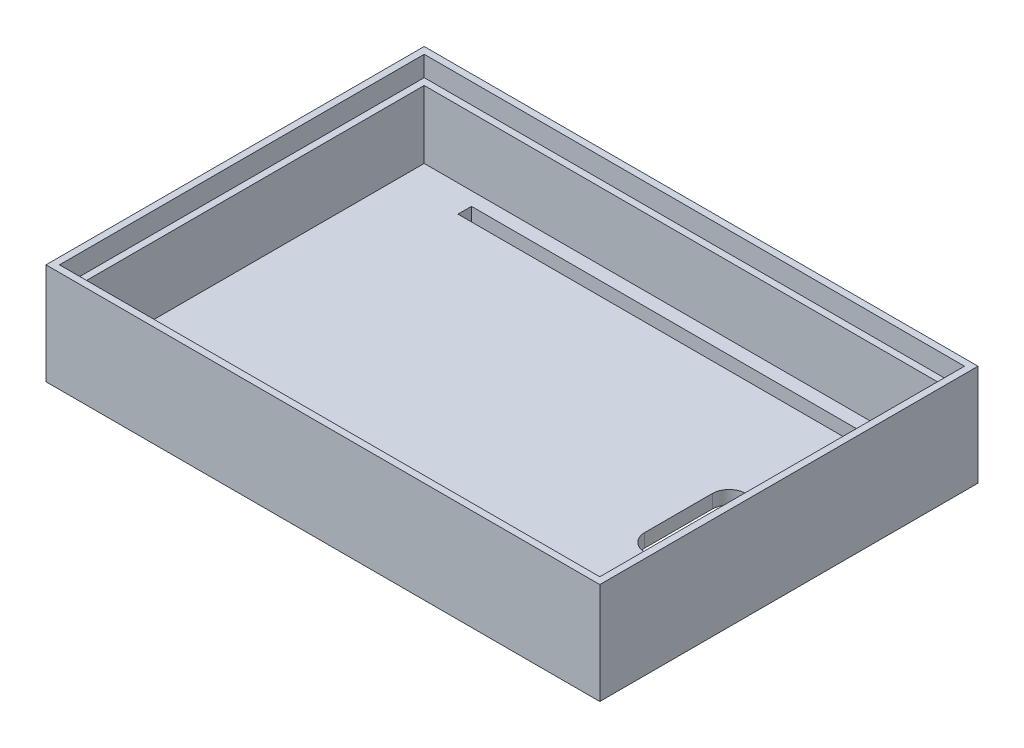
ISO-10303-21;
HEADER;
FILE_DESCRIPTION(('STEP AP214'),'2;1');
FILE_NAME('part.step','',(''),(''),'','','');
FILE_SCHEMA(('AUTOMOTIVE_DESIGN { 1 0 10303 214 1 1 1 1 }'));
ENDSEC;
DATA;
#1=APPLICATION_CONTEXT('core data for automotive mechanical design processes');
#2=APPLICATION_PROTOCOL_DEFINITION('international standard','automotive_design',2000,#1);
#3=PRODUCT_CONTEXT('',#1,'mechanical');
#4=PRODUCT('Part','Part','',(#3));
#5=PRODUCT_RELATED_PRODUCT_CATEGORY('part','',(#4));
#6=PRODUCT_DEFINITION_FORMATION('','',#4);
#7=PRODUCT_DEFINITION_CONTEXT('part definition',#1,'design');
#8=PRODUCT_DEFINITION('design','',#6,#7);
#9=PRODUCT_DEFINITION_SHAPE('','',#8);
#10=(LENGTH_UNIT() NAMED_UNIT(*) SI_UNIT(.MILLI.,.METRE.));
#11=(NAMED_UNIT(*) PLANE_ANGLE_UNIT() SI_UNIT($,.RADIAN.));
#12=(NAMED_UNIT(*) SI_UNIT($,.STERADIAN.) SOLID_ANGLE_UNIT());
#13=UNCERTAINTY_MEASURE_WITH_UNIT(LENGTH_MEASURE(1.E-05),#10,'distance_accuracy_value','');
#14=(GEOMETRIC_REPRESENTATION_CONTEXT(3) GLOBAL_UNCERTAINTY_ASSIGNED_CONTEXT((#13)) GLOBAL_UNIT_ASSIGNED_CONTEXT((#10,
#11,#12)) REPRESENTATION_CONTEXT('',''));
#15=CARTESIAN_POINT('',(0.,0.,0.));
#16=DIRECTION('',(0.,0.,1.));
#17=DIRECTION('',(1.,0.,0.));
#18=AXIS2_PLACEMENT_3D('',#15,#16,#17);
#19=CARTESIAN_POINT('',(0.,15.,0.));
#20=DIRECTION('',(1.,0.,0.));
#21=DIRECTION('',(0.,0.,-1.));
#22=AXIS2_PLACEMENT_3D('',#19,#20,#21);
#23=PLANE('',#22);
#24=DIRECTION('',(0.,0.,1.));
#25=VECTOR('',#24,1.);
#26=CARTESIAN_POINT('',(0.,0.,0.));
#27=LINE('',#26,#25);
#28=CARTESIAN_POINT('',(0.,0.,-56.));
#29=VERTEX_POINT('',#28);
#30=CARTESIAN_POINT('',(0.,0.,0.));
#31=VERTEX_POINT('',#30);
#32=EDGE_CURVE('E543',#29,#31,#27,.T.);
#33=ORIENTED_EDGE('',*,*,#32,.T.);
#34=DIRECTION('',(0.,-1.,0.));
#35=VECTOR('',#34,1.);
#36=CARTESIAN_POINT('',(0.,15.,0.));
#37=LINE('',#36,#35);
#38=CARTESIAN_POINT('',(0.,15.,0.));
#39=VERTEX_POINT('',#38);
#40=EDGE_CURVE('E590',#39,#31,#37,.T.);
#41=ORIENTED_EDGE('',*,*,#40,.F.);
#42=DIRECTION('',(0.,0.,1.));
#43=VECTOR('',#42,1.);
#44=CARTESIAN_POINT('',(0.,15.,0.));
#45=LINE('',#44,#43);
#46=CARTESIAN_POINT('',(0.,15.,-56.));
#47=VERTEX_POINT('',#46);
#48=EDGE_CURVE('E553',#47,#39,#45,.T.);
#49=ORIENTED_EDGE('',*,*,#48,.F.);
#50=DIRECTION('',(0.,-1.,0.));
#51=VECTOR('',#50,1.);
#52=CARTESIAN_POINT('',(0.,15.,-56.));
#53=LINE('',#52,#51);
#54=EDGE_CURVE('E567',#47,#29,#53,.T.);
#55=ORIENTED_EDGE('',*,*,#54,.T.);
#56=EDGE_LOOP('',(#33,#41,#49,#55));
#57=FACE_BOUND('',#56,.T.);
#58=ADVANCED_FACE('F160',(#57),#23,.F.);
#59=CARTESIAN_POINT('',(0.,15.,0.));
#60=DIRECTION('',(0.,0.,-1.));
#61=DIRECTION('',(-1.,0.,0.));
#62=AXIS2_PLACEMENT_3D('',#59,#60,#61);
#63=PLANE('',#62);
#64=DIRECTION('',(1.,0.,0.));
#65=VECTOR('',#64,1.);
#66=CARTESIAN_POINT('',(0.,0.,0.));
#67=LINE('',#66,#65);
#68=CARTESIAN_POINT('',(82.,0.,0.));
#69=VERTEX_POINT('',#68);
#70=EDGE_CURVE('E571',#31,#69,#67,.T.);
#71=ORIENTED_EDGE('',*,*,#70,.T.);
#72=DIRECTION('',(0.,-1.,0.));
#73=VECTOR('',#72,1.);
#74=CARTESIAN_POINT('',(82.,15.,0.));
#75=LINE('',#74,#73);
#76=CARTESIAN_POINT('',(82.,15.,0.));
#77=VERTEX_POINT('',#76);
#78=EDGE_CURVE('E586',#77,#69,#75,.T.);
#79=ORIENTED_EDGE('',*,*,#78,.F.);
#80=DIRECTION('',(1.,0.,0.));
#81=VECTOR('',#80,1.);
#82=CARTESIAN_POINT('',(0.,15.,0.));
#83=LINE('',#82,#81);
#84=EDGE_CURVE('E557',#39,#77,#83,.T.);
#85=ORIENTED_EDGE('',*,*,#84,.F.);
#86=ORIENTED_EDGE('',*,*,#40,.T.);
#87=EDGE_LOOP('',(#71,#79,#85,#86));
#88=FACE_BOUND('',#87,.T.);
#89=ADVANCED_FACE('F661',(#88),#63,.F.);
#90=CARTESIAN_POINT('',(82.,15.,0.));
#91=DIRECTION('',(-1.,0.,0.));
#92=DIRECTION('',(0.,0.,1.));
#93=AXIS2_PLACEMENT_3D('',#90,#91,#92);
#94=PLANE('',#93);
#95=DIRECTION('',(0.,0.,-1.));
#96=VECTOR('',#95,1.);
#97=CARTESIAN_POINT('',(82.,0.,0.));
#98=LINE('',#97,#96);
#99=CARTESIAN_POINT('',(82.,0.,-56.));
#100=VERTEX_POINT('',#99);
#101=EDGE_CURVE('E574',#69,#100,#98,.T.);
#102=ORIENTED_EDGE('',*,*,#101,.T.);
#103=DIRECTION('',(0.,-1.,0.));
#104=VECTOR('',#103,1.);
#105=CARTESIAN_POINT('',(82.,15.,-56.));
#106=LINE('',#105,#104);
#107=CARTESIAN_POINT('',(82.,15.,-56.));
#108=VERTEX_POINT('',#107);
#109=EDGE_CURVE('E582',#108,#100,#106,.T.);
#110=ORIENTED_EDGE('',*,*,#109,.F.);
#111=DIRECTION('',(0.,0.,-1.));
#112=VECTOR('',#111,1.);
#113=CARTESIAN_POINT('',(82.,15.,0.));
#114=LINE('',#113,#112);
#115=EDGE_CURVE('E561',#77,#108,#114,.T.);
#116=ORIENTED_EDGE('',*,*,#115,.F.);
#117=ORIENTED_EDGE('',*,*,#78,.T.);
#118=EDGE_LOOP('',(#102,#110,#116,#117));
#119=FACE_BOUND('',#118,.T.);
#120=ADVANCED_FACE('F666',(#119),#94,.F.);
#121=CARTESIAN_POINT('',(0.,15.,-56.));
#122=DIRECTION('',(0.,0.,1.));
#123=DIRECTION('',(1.,0.,0.));
#124=AXIS2_PLACEMENT_3D('',#121,#122,#123);
#125=PLANE('',#124);
#126=DIRECTION('',(-1.,0.,0.));
#127=VECTOR('',#126,1.);
#128=CARTESIAN_POINT('',(0.,0.,-56.));
#129=LINE('',#128,#127);
#130=EDGE_CURVE('E558',#100,#29,#129,.T.);
#131=ORIENTED_EDGE('',*,*,#130,.T.);
#132=ORIENTED_EDGE('',*,*,#54,.F.);
#133=DIRECTION('',(-1.,0.,0.));
#134=VECTOR('',#133,1.);
#135=CARTESIAN_POINT('',(0.,15.,-56.));
#136=LINE('',#135,#134);
#137=EDGE_CURVE('E564',#108,#47,#136,.T.);
#138=ORIENTED_EDGE('',*,*,#137,.F.);
#139=ORIENTED_EDGE('',*,*,#109,.T.);
#140=EDGE_LOOP('',(#131,#132,#138,#139));
#141=FACE_BOUND('',#140,.T.);
#142=ADVANCED_FACE('F682',(#141),#125,.F.);
#143=CARTESIAN_POINT('',(0.,15.,0.));
#144=DIRECTION('',(0.,-1.,0.));
#145=DIRECTION('',(0.,0.,-1.));
#146=AXIS2_PLACEMENT_3D('',#143,#144,#145);
#147=PLANE('',#146);
#148=DIRECTION('',(1.,0.,0.));
#149=VECTOR('',#148,1.);
#150=CARTESIAN_POINT('',(1.00000000000001,15.,-1.));
#151=LINE('',#150,#149);
#152=CARTESIAN_POINT('',(1.00000000000001,15.,-1.));
#153=VERTEX_POINT('',#152);
#154=CARTESIAN_POINT('',(81.,15.,-1.));
#155=VERTEX_POINT('',#154);
#156=EDGE_CURVE('E529',#153,#155,#151,.T.);
#157=ORIENTED_EDGE('',*,*,#156,.F.);
#158=DIRECTION('',(0.,0.,1.));
#159=VECTOR('',#158,1.);
#160=CARTESIAN_POINT('',(1.,15.,-55.));
#161=LINE('',#160,#159);
#162=CARTESIAN_POINT('',(1.,15.,-55.));
#163=VERTEX_POINT('',#162);
#164=EDGE_CURVE('E460',#163,#153,#161,.T.);
#165=ORIENTED_EDGE('',*,*,#164,.F.);
#166=DIRECTION('',(-1.,0.,0.));
#167=VECTOR('',#166,1.);
#168=CARTESIAN_POINT('',(1.,15.,-55.));
#169=LINE('',#168,#167);
#170=CARTESIAN_POINT('',(81.,15.,-55.));
#171=VERTEX_POINT('',#170);
#172=EDGE_CURVE('E514',#171,#163,#169,.T.);
#173=ORIENTED_EDGE('',*,*,#172,.F.);
#174=DIRECTION('',(0.,0.,-1.));
#175=VECTOR('',#174,1.);
#176=CARTESIAN_POINT('',(81.,15.,-55.));
#177=LINE('',#176,#175);
#178=EDGE_CURVE('E533',#155,#171,#177,.T.);
#179=ORIENTED_EDGE('',*,*,#178,.F.);
#180=EDGE_LOOP('',(#157,#165,#173,#179));
#181=FACE_BOUND('',#180,.T.);
#182=ORIENTED_EDGE('',*,*,#48,.T.);
#183=ORIENTED_EDGE('',*,*,#84,.T.);
#184=ORIENTED_EDGE('',*,*,#115,.T.);
#185=ORIENTED_EDGE('',*,*,#137,.T.);
#186=EDGE_LOOP('',(#182,#183,#184,#185));
#187=FACE_BOUND('',#186,.T.);
#188=ADVANCED_FACE('F678',(#181,#187),#147,.F.);
#189=CARTESIAN_POINT('',(0.,0.,0.));
#190=DIRECTION('',(0.,-1.,0.));
#191=DIRECTION('',(0.,0.,-1.));
#192=AXIS2_PLACEMENT_3D('',#189,#190,#191);
#193=PLANE('',#192);
#194=DIRECTION('',(0.,0.,-1.));
#195=VECTOR('',#194,1.);
#196=CARTESIAN_POINT('',(11.,0.,-4.));
#197=LINE('',#196,#195);
#198=CARTESIAN_POINT('',(11.,0.,-4.));
#199=VERTEX_POINT('',#198);
#200=CARTESIAN_POINT('',(11.,0.,-5.99999999999999));
#201=VERTEX_POINT('',#200);
#202=EDGE_CURVE('E175',#199,#201,#197,.T.);
#203=ORIENTED_EDGE('',*,*,#202,.F.);
#204=DIRECTION('',(-1.,0.,0.));
#205=VECTOR('',#204,1.);
#206=CARTESIAN_POINT('',(11.,0.,-4.));
#207=LINE('',#206,#205);
#208=CARTESIAN_POINT('',(71.,0.,-3.99999999999999));
#209=VERTEX_POINT('',#208);
#210=EDGE_CURVE('E359',#209,#199,#207,.T.);
#211=ORIENTED_EDGE('',*,*,#210,.F.);
#212=DIRECTION('',(0.,0.,1.));
#213=VECTOR('',#212,1.);
#214=CARTESIAN_POINT('',(71.,0.,-3.99999999999999));
#215=LINE('',#214,#213);
#216=CARTESIAN_POINT('',(71.,0.,-5.99999999999999));
#217=VERTEX_POINT('',#216);
#218=EDGE_CURVE('E340',#217,#209,#215,.T.);
#219=ORIENTED_EDGE('',*,*,#218,.F.);
#220=DIRECTION('',(1.,0.,0.));
#221=VECTOR('',#220,1.);
#222=CARTESIAN_POINT('',(11.,0.,-5.99999999999999));
#223=LINE('',#222,#221);
#224=EDGE_CURVE('E351',#201,#217,#223,.T.);
#225=ORIENTED_EDGE('',*,*,#224,.F.);
#226=EDGE_LOOP('',(#203,#211,#219,#225));
#227=FACE_BOUND('',#226,.T.);
#228=DIRECTION('',(0.,0.,-1.));
#229=VECTOR('',#228,1.);
#230=CARTESIAN_POINT('',(11.,0.,-52.));
#231=LINE('',#230,#229);
#232=CARTESIAN_POINT('',(11.,0.,-50.));
#233=VERTEX_POINT('',#232);
#234=CARTESIAN_POINT('',(11.,0.,-52.));
#235=VERTEX_POINT('',#234);
#236=EDGE_CURVE('E183',#233,#235,#231,.T.);
#237=ORIENTED_EDGE('',*,*,#236,.F.);
#238=DIRECTION('',(-1.,0.,0.));
#239=VECTOR('',#238,1.);
#240=CARTESIAN_POINT('',(11.,0.,-50.));
#241=LINE('',#240,#239);
#242=CARTESIAN_POINT('',(71.,0.,-50.));
#243=VERTEX_POINT('',#242);
#244=EDGE_CURVE('E377',#243,#233,#241,.T.);
#245=ORIENTED_EDGE('',*,*,#244,.F.);
#246=DIRECTION('',(0.,0.,1.));
#247=VECTOR('',#246,1.);
#248=CARTESIAN_POINT('',(71.,0.,-52.));
#249=LINE('',#248,#247);
#250=CARTESIAN_POINT('',(71.,0.,-52.));
#251=VERTEX_POINT('',#250);
#252=EDGE_CURVE('E391',#251,#243,#249,.T.);
#253=ORIENTED_EDGE('',*,*,#252,.F.);
#254=DIRECTION('',(1.,0.,0.));
#255=VECTOR('',#254,1.);
#256=CARTESIAN_POINT('',(11.,0.,-52.));
#257=LINE('',#256,#255);
#258=EDGE_CURVE('E395',#235,#251,#257,.T.);
#259=ORIENTED_EDGE('',*,*,#258,.F.);
#260=EDGE_LOOP('',(#237,#245,#253,#259));
#261=FACE_BOUND('',#260,.T.);
#262=CARTESIAN_POINT('',(68.1538059373532,0.,-23.));
#263=DIRECTION('',(0.,-1.,0.));
#264=DIRECTION('',(0.,0.,-1.));
#265=AXIS2_PLACEMENT_3D('',#262,#263,#264);
#266=CIRCLE('',#265,2.5);
#267=CARTESIAN_POINT('',(70.6538059373532,0.,-23.));
#268=VERTEX_POINT('',#267);
#269=CARTESIAN_POINT('',(65.6538059373532,0.,-23.));
#270=VERTEX_POINT('',#269);
#271=EDGE_CURVE('E387',#268,#270,#266,.T.);
#272=ORIENTED_EDGE('',*,*,#271,.F.);
#273=DIRECTION('',(0.,0.,1.));
#274=VECTOR('',#273,1.);
#275=CARTESIAN_POINT('',(70.6538059373532,0.,-23.));
#276=LINE('',#275,#274);
#277=CARTESIAN_POINT('',(70.6538059373532,0.,-25.5));
#278=VERTEX_POINT('',#277);
#279=EDGE_CURVE('E405',#278,#268,#276,.T.);
#280=ORIENTED_EDGE('',*,*,#279,.F.);
#281=CARTESIAN_POINT('',(70.6538059373532,0.,-28.));
#282=DIRECTION('',(0.,-1.,0.));
#283=DIRECTION('',(0.,0.,1.));
#284=AXIS2_PLACEMENT_3D('',#281,#282,#283);
#285=CIRCLE('',#284,2.5);
#286=CARTESIAN_POINT('',(70.6538059373532,0.,-30.5));
#287=VERTEX_POINT('',#286);
#288=EDGE_CURVE('E424',#287,#278,#285,.T.);
#289=ORIENTED_EDGE('',*,*,#288,.F.);
#290=DIRECTION('',(0.,0.,1.));
#291=VECTOR('',#290,1.);
#292=CARTESIAN_POINT('',(70.6538059373532,0.,-30.5));
#293=LINE('',#292,#291);
#294=CARTESIAN_POINT('',(70.6538059373532,0.,-33.));
#295=VERTEX_POINT('',#294);
#296=EDGE_CURVE('E428',#295,#287,#293,.T.);
#297=ORIENTED_EDGE('',*,*,#296,.F.);
#298=CARTESIAN_POINT('',(68.1538059373532,0.,-33.));
#299=DIRECTION('',(0.,-1.,0.));
#300=DIRECTION('',(0.,0.,-1.));
#301=AXIS2_PLACEMENT_3D('',#298,#299,#300);
#302=CIRCLE('',#301,2.5);
#303=CARTESIAN_POINT('',(65.6538059373532,0.,-33.));
#304=VERTEX_POINT('',#303);
#305=EDGE_CURVE('E432',#304,#295,#302,.T.);
#306=ORIENTED_EDGE('',*,*,#305,.F.);
#307=DIRECTION('',(0.,0.,-1.));
#308=VECTOR('',#307,1.);
#309=CARTESIAN_POINT('',(65.6538059373532,0.,-23.));
#310=LINE('',#309,#308);
#311=EDGE_CURVE('E436',#270,#304,#310,.T.);
#312=ORIENTED_EDGE('',*,*,#311,.F.);
#313=EDGE_LOOP('',(#272,#280,#289,#297,#306,#312));
#314=FACE_BOUND('',#313,.T.);
#315=ORIENTED_EDGE('',*,*,#32,.F.);
#316=ORIENTED_EDGE('',*,*,#130,.F.);
#317=ORIENTED_EDGE('',*,*,#101,.F.);
#318=ORIENTED_EDGE('',*,*,#70,.F.);
#319=EDGE_LOOP('',(#315,#316,#317,#318));
#320=FACE_BOUND('',#319,.T.);
#321=ADVANCED_FACE('F356',(#227,#261,#314,#320),#193,.T.);
#322=CARTESIAN_POINT('',(1.,12.,-55.));
#323=DIRECTION('',(-1.,0.,0.));
#324=DIRECTION('',(0.,0.,1.));
#325=AXIS2_PLACEMENT_3D('',#322,#323,#324);
#326=PLANE('',#325);
#327=ORIENTED_EDGE('',*,*,#164,.T.);
#328=DIRECTION('',(0.,1.,0.));
#329=VECTOR('',#328,1.);
#330=CARTESIAN_POINT('',(1.00000000000001,12.,-1.));
#331=LINE('',#330,#329);
#332=CARTESIAN_POINT('',(1.00000000000001,12.,-1.));
#333=VERTEX_POINT('',#332);
#334=EDGE_CURVE('E526',#333,#153,#331,.T.);
#335=ORIENTED_EDGE('',*,*,#334,.F.);
#336=DIRECTION('',(0.,0.,1.));
#337=VECTOR('',#336,1.);
#338=CARTESIAN_POINT('',(1.,12.,-55.));
#339=LINE('',#338,#337);
#340=CARTESIAN_POINT('',(1.,12.,-55.));
#341=VERTEX_POINT('',#340);
#342=EDGE_CURVE('E509',#341,#333,#339,.T.);
#343=ORIENTED_EDGE('',*,*,#342,.F.);
#344=DIRECTION('',(0.,1.,0.));
#345=VECTOR('',#344,1.);
#346=CARTESIAN_POINT('',(1.,12.,-55.));
#347=LINE('',#346,#345);
#348=EDGE_CURVE('E540',#341,#163,#347,.T.);
#349=ORIENTED_EDGE('',*,*,#348,.T.);
#350=EDGE_LOOP('',(#327,#335,#343,#349));
#351=FACE_BOUND('',#350,.T.);
#352=ADVANCED_FACE('F693',(#351),#326,.F.);
#353=CARTESIAN_POINT('',(1.,12.,-55.));
#354=DIRECTION('',(0.,0.,-1.));
#355=DIRECTION('',(-1.,0.,0.));
#356=AXIS2_PLACEMENT_3D('',#353,#354,#355);
#357=PLANE('',#356);
#358=ORIENTED_EDGE('',*,*,#172,.T.);
#359=ORIENTED_EDGE('',*,*,#348,.F.);
#360=DIRECTION('',(-1.,0.,0.));
#361=VECTOR('',#360,1.);
#362=CARTESIAN_POINT('',(1.,12.,-55.));
#363=LINE('',#362,#361);
#364=CARTESIAN_POINT('',(81.,12.,-55.));
#365=VERTEX_POINT('',#364);
#366=EDGE_CURVE('E522',#365,#341,#363,.T.);
#367=ORIENTED_EDGE('',*,*,#366,.F.);
#368=DIRECTION('',(0.,1.,0.));
#369=VECTOR('',#368,1.);
#370=CARTESIAN_POINT('',(81.,12.,-55.));
#371=LINE('',#370,#369);
#372=EDGE_CURVE('E544',#365,#171,#371,.T.);
#373=ORIENTED_EDGE('',*,*,#372,.T.);
#374=EDGE_LOOP('',(#358,#359,#367,#373));
#375=FACE_BOUND('',#374,.T.);
#376=ADVANCED_FACE('F699',(#375),#357,.F.);
#377=CARTESIAN_POINT('',(81.,12.,-55.));
#378=DIRECTION('',(1.,0.,0.));
#379=DIRECTION('',(0.,0.,-1.));
#380=AXIS2_PLACEMENT_3D('',#377,#378,#379);
#381=PLANE('',#380);
#382=ORIENTED_EDGE('',*,*,#178,.T.);
#383=ORIENTED_EDGE('',*,*,#372,.F.);
#384=DIRECTION('',(0.,0.,-1.));
#385=VECTOR('',#384,1.);
#386=CARTESIAN_POINT('',(81.,12.,-55.));
#387=LINE('',#386,#385);
#388=CARTESIAN_POINT('',(81.,12.,-1.));
#389=VERTEX_POINT('',#388);
#390=EDGE_CURVE('E518',#389,#365,#387,.T.);
#391=ORIENTED_EDGE('',*,*,#390,.F.);
#392=DIRECTION('',(0.,1.,0.));
#393=VECTOR('',#392,1.);
#394=CARTESIAN_POINT('',(81.,12.,-1.));
#395=LINE('',#394,#393);
#396=EDGE_CURVE('E547',#389,#155,#395,.T.);
#397=ORIENTED_EDGE('',*,*,#396,.T.);
#398=EDGE_LOOP('',(#382,#383,#391,#397));
#399=FACE_BOUND('',#398,.T.);
#400=ADVANCED_FACE('F705',(#399),#381,.F.);
#401=CARTESIAN_POINT('',(1.00000000000001,12.,-1.));
#402=DIRECTION('',(0.,0.,1.));
#403=DIRECTION('',(1.,0.,0.));
#404=AXIS2_PLACEMENT_3D('',#401,#402,#403);
#405=PLANE('',#404);
#406=ORIENTED_EDGE('',*,*,#156,.T.);
#407=ORIENTED_EDGE('',*,*,#396,.F.);
#408=DIRECTION('',(1.,0.,0.));
#409=VECTOR('',#408,1.);
#410=CARTESIAN_POINT('',(1.00000000000001,12.,-1.));
#411=LINE('',#410,#409);
#412=EDGE_CURVE('E513',#333,#389,#411,.T.);
#413=ORIENTED_EDGE('',*,*,#412,.F.);
#414=ORIENTED_EDGE('',*,*,#334,.T.);
#415=EDGE_LOOP('',(#406,#407,#413,#414));
#416=FACE_BOUND('',#415,.T.);
#417=ADVANCED_FACE('F701',(#416),#405,.F.);
#418=CARTESIAN_POINT('',(0.,12.,0.));
#419=DIRECTION('',(0.,1.,0.));
#420=DIRECTION('',(0.,0.,1.));
#421=AXIS2_PLACEMENT_3D('',#418,#419,#420);
#422=PLANE('',#421);
#423=DIRECTION('',(1.,0.,0.));
#424=VECTOR('',#423,1.);
#425=CARTESIAN_POINT('',(2.,12.,-2.00000000000001));
#426=LINE('',#425,#424);
#427=CARTESIAN_POINT('',(2.,12.,-2.00000000000001));
#428=VERTEX_POINT('',#427);
#429=CARTESIAN_POINT('',(80.,12.,-2.));
#430=VERTEX_POINT('',#429);
#431=EDGE_CURVE('E456',#428,#430,#426,.T.);
#432=ORIENTED_EDGE('',*,*,#431,.F.);
#433=DIRECTION('',(0.,0.,1.));
#434=VECTOR('',#433,1.);
#435=CARTESIAN_POINT('',(2.,12.,-54.));
#436=LINE('',#435,#434);
#437=CARTESIAN_POINT('',(2.,12.,-54.));
#438=VERTEX_POINT('',#437);
#439=EDGE_CURVE('E447',#438,#428,#436,.T.);
#440=ORIENTED_EDGE('',*,*,#439,.F.);
#441=DIRECTION('',(-1.,0.,0.));
#442=VECTOR('',#441,1.);
#443=CARTESIAN_POINT('',(80.,12.,-54.));
#444=LINE('',#443,#442);
#445=CARTESIAN_POINT('',(80.,12.,-54.));
#446=VERTEX_POINT('',#445);
#447=EDGE_CURVE('E487',#446,#438,#444,.T.);
#448=ORIENTED_EDGE('',*,*,#447,.F.);
#449=DIRECTION('',(0.,0.,-1.));
#450=VECTOR('',#449,1.);
#451=CARTESIAN_POINT('',(80.,12.,-2.));
#452=LINE('',#451,#450);
#453=EDGE_CURVE('E468',#430,#446,#452,.T.);
#454=ORIENTED_EDGE('',*,*,#453,.F.);
#455=EDGE_LOOP('',(#432,#440,#448,#454));
#456=FACE_BOUND('',#455,.T.);
#457=ORIENTED_EDGE('',*,*,#342,.T.);
#458=ORIENTED_EDGE('',*,*,#412,.T.);
#459=ORIENTED_EDGE('',*,*,#390,.T.);
#460=ORIENTED_EDGE('',*,*,#366,.T.);
#461=EDGE_LOOP('',(#457,#458,#459,#460));
#462=FACE_BOUND('',#461,.T.);
#463=ADVANCED_FACE('F704',(#456,#462),#422,.T.);
#464=CARTESIAN_POINT('',(0.,2.,0.));
#465=DIRECTION('',(0.,-1.,0.));
#466=DIRECTION('',(0.,0.,-1.));
#467=AXIS2_PLACEMENT_3D('',#464,#465,#466);
#468=PLANE('',#467);
#469=DIRECTION('',(-1.,0.,0.));
#470=VECTOR('',#469,1.);
#471=CARTESIAN_POINT('',(0.,2.,-4.00000000000001));
#472=LINE('',#471,#470);
#473=CARTESIAN_POINT('',(71.,2.,-3.99999999999999));
#474=VERTEX_POINT('',#473);
#475=CARTESIAN_POINT('',(11.,2.,-4.));
#476=VERTEX_POINT('',#475);
#477=EDGE_CURVE('E168',#474,#476,#472,.T.);
#478=ORIENTED_EDGE('',*,*,#477,.T.);
#479=DIRECTION('',(0.,0.,-1.));
#480=VECTOR('',#479,1.);
#481=CARTESIAN_POINT('',(11.,2.,0.));
#482=LINE('',#481,#480);
#483=CARTESIAN_POINT('',(11.,2.,-5.99999999999999));
#484=VERTEX_POINT('',#483);
#485=EDGE_CURVE('E14',#476,#484,#482,.T.);
#486=ORIENTED_EDGE('',*,*,#485,.T.);
#487=DIRECTION('',(1.,0.,0.));
#488=VECTOR('',#487,1.);
#489=CARTESIAN_POINT('',(0.,2.,-5.99999999999999));
#490=LINE('',#489,#488);
#491=CARTESIAN_POINT('',(71.,2.,-5.99999999999999));
#492=VERTEX_POINT('',#491);
#493=EDGE_CURVE('E634',#484,#492,#490,.T.);
#494=ORIENTED_EDGE('',*,*,#493,.T.);
#495=DIRECTION('',(0.,0.,1.));
#496=VECTOR('',#495,1.);
#497=CARTESIAN_POINT('',(71.,2.,0.));
#498=LINE('',#497,#496);
#499=EDGE_CURVE('E343',#492,#474,#498,.T.);
#500=ORIENTED_EDGE('',*,*,#499,.T.);
#501=EDGE_LOOP('',(#478,#486,#494,#500));
#502=FACE_BOUND('',#501,.T.);
#503=DIRECTION('',(-1.,0.,0.));
#504=VECTOR('',#503,1.);
#505=CARTESIAN_POINT('',(0.,2.,-50.));
#506=LINE('',#505,#504);
#507=CARTESIAN_POINT('',(71.,2.,-50.));
#508=VERTEX_POINT('',#507);
#509=CARTESIAN_POINT('',(11.,2.,-50.));
#510=VERTEX_POINT('',#509);
#511=EDGE_CURVE('E626',#508,#510,#506,.T.);
#512=ORIENTED_EDGE('',*,*,#511,.T.);
#513=DIRECTION('',(0.,0.,-1.));
#514=VECTOR('',#513,1.);
#515=CARTESIAN_POINT('',(10.9999999999998,2.,0.));
#516=LINE('',#515,#514);
#517=CARTESIAN_POINT('',(11.,2.,-52.));
#518=VERTEX_POINT('',#517);
#519=EDGE_CURVE('E630',#510,#518,#516,.T.);
#520=ORIENTED_EDGE('',*,*,#519,.T.);
#521=DIRECTION('',(1.,0.,0.));
#522=VECTOR('',#521,1.);
#523=CARTESIAN_POINT('',(0.,2.,-52.));
#524=LINE('',#523,#522);
#525=CARTESIAN_POINT('',(71.,2.,-52.));
#526=VERTEX_POINT('',#525);
#527=EDGE_CURVE('E618',#518,#526,#524,.T.);
#528=ORIENTED_EDGE('',*,*,#527,.T.);
#529=DIRECTION('',(0.,0.,1.));
#530=VECTOR('',#529,1.);
#531=CARTESIAN_POINT('',(71.,2.,0.));
#532=LINE('',#531,#530);
#533=EDGE_CURVE('E622',#526,#508,#532,.T.);
#534=ORIENTED_EDGE('',*,*,#533,.T.);
#535=EDGE_LOOP('',(#512,#520,#528,#534));
#536=FACE_BOUND('',#535,.T.);
#537=DIRECTION('',(0.,0.,1.));
#538=VECTOR('',#537,1.);
#539=CARTESIAN_POINT('',(70.6538059373532,2.,0.));
#540=LINE('',#539,#538);
#541=CARTESIAN_POINT('',(70.6538059373532,2.,-25.5));
#542=VERTEX_POINT('',#541);
#543=CARTESIAN_POINT('',(70.6538059373532,2.,-23.));
#544=VERTEX_POINT('',#543);
#545=EDGE_CURVE('E610',#542,#544,#540,.T.);
#546=ORIENTED_EDGE('',*,*,#545,.T.);
#547=CARTESIAN_POINT('',(68.1538059373532,2.,-23.));
#548=DIRECTION('',(0.,-1.,0.));
#549=DIRECTION('',(0.,0.,-1.));
#550=AXIS2_PLACEMENT_3D('',#547,#548,#549);
#551=CIRCLE('',#550,2.5);
#552=CARTESIAN_POINT('',(65.6538059373532,2.,-23.));
#553=VERTEX_POINT('',#552);
#554=EDGE_CURVE('E614',#544,#553,#551,.T.);
#555=ORIENTED_EDGE('',*,*,#554,.T.);
#556=DIRECTION('',(0.,0.,-1.));
#557=VECTOR('',#556,1.);
#558=CARTESIAN_POINT('',(65.6538059373532,2.,0.));
#559=LINE('',#558,#557);
#560=CARTESIAN_POINT('',(65.6538059373532,2.,-33.));
#561=VERTEX_POINT('',#560);
#562=EDGE_CURVE('E594',#553,#561,#559,.T.);
#563=ORIENTED_EDGE('',*,*,#562,.T.);
#564=CARTESIAN_POINT('',(68.1538059373532,2.,-33.));
#565=DIRECTION('',(0.,-1.,0.));
#566=DIRECTION('',(0.,0.,-1.));
#567=AXIS2_PLACEMENT_3D('',#564,#565,#566);
#568=CIRCLE('',#567,2.5);
#569=CARTESIAN_POINT('',(70.6538059373532,2.,-33.));
#570=VERTEX_POINT('',#569);
#571=EDGE_CURVE('E598',#561,#570,#568,.T.);
#572=ORIENTED_EDGE('',*,*,#571,.T.);
#573=DIRECTION('',(0.,0.,1.));
#574=VECTOR('',#573,1.);
#575=CARTESIAN_POINT('',(70.6538059373532,2.,0.));
#576=LINE('',#575,#574);
#577=CARTESIAN_POINT('',(70.6538059373532,2.,-30.5));
#578=VERTEX_POINT('',#577);
#579=EDGE_CURVE('E602',#570,#578,#576,.T.);
#580=ORIENTED_EDGE('',*,*,#579,.T.);
#581=CARTESIAN_POINT('',(70.6538059373532,2.,-28.));
#582=DIRECTION('',(0.,-1.,0.));
#583=DIRECTION('',(0.,0.,-1.));
#584=AXIS2_PLACEMENT_3D('',#581,#582,#583);
#585=CIRCLE('',#584,2.5);
#586=EDGE_CURVE('E606',#578,#542,#585,.T.);
#587=ORIENTED_EDGE('',*,*,#586,.T.);
#588=EDGE_LOOP('',(#546,#555,#563,#572,#580,#587));
#589=FACE_BOUND('',#588,.T.);
#590=DIRECTION('',(1.,0.,0.));
#591=VECTOR('',#590,1.);
#592=CARTESIAN_POINT('',(2.,2.,-2.00000000000001));
#593=LINE('',#592,#591);
#594=CARTESIAN_POINT('',(2.,2.,-2.00000000000001));
#595=VERTEX_POINT('',#594);
#596=CARTESIAN_POINT('',(80.,2.,-2.));
#597=VERTEX_POINT('',#596);
#598=EDGE_CURVE('E461',#595,#597,#593,.T.);
#599=ORIENTED_EDGE('',*,*,#598,.T.);
#600=DIRECTION('',(0.,0.,-1.));
#601=VECTOR('',#600,1.);
#602=CARTESIAN_POINT('',(80.,2.,-2.));
#603=LINE('',#602,#601);
#604=CARTESIAN_POINT('',(80.,2.,-54.));
#605=VERTEX_POINT('',#604);
#606=EDGE_CURVE('E469',#597,#605,#603,.T.);
#607=ORIENTED_EDGE('',*,*,#606,.T.);
#608=DIRECTION('',(-1.,0.,0.));
#609=VECTOR('',#608,1.);
#610=CARTESIAN_POINT('',(80.,2.,-54.));
#611=LINE('',#610,#609);
#612=CARTESIAN_POINT('',(2.,2.,-54.));
#613=VERTEX_POINT('',#612);
#614=EDGE_CURVE('E446',#605,#613,#611,.T.);
#615=ORIENTED_EDGE('',*,*,#614,.T.);
#616=DIRECTION('',(0.,0.,1.));
#617=VECTOR('',#616,1.);
#618=CARTESIAN_POINT('',(2.,2.,-54.));
#619=LINE('',#618,#617);
#620=EDGE_CURVE('E369',#613,#595,#619,.T.);
#621=ORIENTED_EDGE('',*,*,#620,.T.);
#622=EDGE_LOOP('',(#599,#607,#615,#621));
#623=FACE_BOUND('',#622,.T.);
#624=ADVANCED_FACE('F641',(#502,#536,#589,#623),#468,.F.);
#625=CARTESIAN_POINT('',(2.,12.,-54.));
#626=DIRECTION('',(1.,0.,0.));
#627=DIRECTION('',(0.,0.,-1.));
#628=AXIS2_PLACEMENT_3D('',#625,#626,#627);
#629=PLANE('',#628);
#630=ORIENTED_EDGE('',*,*,#620,.F.);
#631=DIRECTION('',(0.,-1.,0.));
#632=VECTOR('',#631,1.);
#633=CARTESIAN_POINT('',(2.,12.,-54.));
#634=LINE('',#633,#632);
#635=EDGE_CURVE('E453',#438,#613,#634,.T.);
#636=ORIENTED_EDGE('',*,*,#635,.F.);
#637=ORIENTED_EDGE('',*,*,#439,.T.);
#638=DIRECTION('',(0.,-1.,0.));
#639=VECTOR('',#638,1.);
#640=CARTESIAN_POINT('',(2.,12.,-2.00000000000001));
#641=LINE('',#640,#639);
#642=EDGE_CURVE('E442',#428,#595,#641,.T.);
#643=ORIENTED_EDGE('',*,*,#642,.T.);
#644=EDGE_LOOP('',(#630,#636,#637,#643));
#645=FACE_BOUND('',#644,.T.);
#646=ADVANCED_FACE('F750',(#645),#629,.T.);
#647=CARTESIAN_POINT('',(80.,12.,-54.));
#648=DIRECTION('',(0.,0.,1.));
#649=DIRECTION('',(1.,0.,0.));
#650=AXIS2_PLACEMENT_3D('',#647,#648,#649);
#651=PLANE('',#650);
#652=ORIENTED_EDGE('',*,*,#614,.F.);
#653=DIRECTION('',(0.,-1.,0.));
#654=VECTOR('',#653,1.);
#655=CARTESIAN_POINT('',(80.,12.,-54.));
#656=LINE('',#655,#654);
#657=EDGE_CURVE('E490',#446,#605,#656,.T.);
#658=ORIENTED_EDGE('',*,*,#657,.F.);
#659=ORIENTED_EDGE('',*,*,#447,.T.);
#660=ORIENTED_EDGE('',*,*,#635,.T.);
#661=EDGE_LOOP('',(#652,#658,#659,#660));
#662=FACE_BOUND('',#661,.T.);
#663=ADVANCED_FACE('F758',(#662),#651,.T.);
#664=CARTESIAN_POINT('',(80.,12.,-2.));
#665=DIRECTION('',(-1.,0.,0.));
#666=DIRECTION('',(0.,0.,1.));
#667=AXIS2_PLACEMENT_3D('',#664,#665,#666);
#668=PLANE('',#667);
#669=ORIENTED_EDGE('',*,*,#606,.F.);
#670=DIRECTION('',(0.,-1.,0.));
#671=VECTOR('',#670,1.);
#672=CARTESIAN_POINT('',(80.,12.,-2.));
#673=LINE('',#672,#671);
#674=EDGE_CURVE('E464',#430,#597,#673,.T.);
#675=ORIENTED_EDGE('',*,*,#674,.F.);
#676=ORIENTED_EDGE('',*,*,#453,.T.);
#677=ORIENTED_EDGE('',*,*,#657,.T.);
#678=EDGE_LOOP('',(#669,#675,#676,#677));
#679=FACE_BOUND('',#678,.T.);
#680=ADVANCED_FACE('F754',(#679),#668,.T.);
#681=CARTESIAN_POINT('',(2.,12.,-2.00000000000001));
#682=DIRECTION('',(0.,0.,-1.));
#683=DIRECTION('',(-1.,0.,0.));
#684=AXIS2_PLACEMENT_3D('',#681,#682,#683);
#685=PLANE('',#684);
#686=ORIENTED_EDGE('',*,*,#598,.F.);
#687=ORIENTED_EDGE('',*,*,#642,.F.);
#688=ORIENTED_EDGE('',*,*,#431,.T.);
#689=ORIENTED_EDGE('',*,*,#674,.T.);
#690=EDGE_LOOP('',(#686,#687,#688,#689));
#691=FACE_BOUND('',#690,.T.);
#692=ADVANCED_FACE('F716',(#691),#685,.T.);
#693=CARTESIAN_POINT('',(68.1538059373532,11.,-23.));
#694=DIRECTION('',(0.,-1.,0.));
#695=DIRECTION('',(0.,0.,-1.));
#696=AXIS2_PLACEMENT_3D('',#693,#694,#695);
#697=CYLINDRICAL_SURFACE('',#696,2.5);
#698=DIRECTION('',(0.,-1.,0.));
#699=VECTOR('',#698,1.);
#700=CARTESIAN_POINT('',(70.6538059373532,11.,-23.));
#701=LINE('',#700,#699);
#702=EDGE_CURVE('E418',#544,#268,#701,.T.);
#703=ORIENTED_EDGE('',*,*,#702,.T.);
#704=ORIENTED_EDGE('',*,*,#271,.T.);
#705=DIRECTION('',(0.,-1.,0.));
#706=VECTOR('',#705,1.);
#707=CARTESIAN_POINT('',(65.6538059373532,11.,-23.));
#708=LINE('',#707,#706);
#709=EDGE_CURVE('E401',#553,#270,#708,.T.);
#710=ORIENTED_EDGE('',*,*,#709,.F.);
#711=ORIENTED_EDGE('',*,*,#554,.F.);
#712=EDGE_LOOP('',(#703,#704,#710,#711));
#713=FACE_BOUND('',#712,.T.);
#714=ADVANCED_FACE('F751',(#713),#697,.F.);
#715=CARTESIAN_POINT('',(70.6538059373532,11.,-23.));
#716=DIRECTION('',(1.,0.,0.));
#717=DIRECTION('',(0.,0.,-1.));
#718=AXIS2_PLACEMENT_3D('',#715,#716,#717);
#719=PLANE('',#718);
#720=DIRECTION('',(0.,-1.,0.));
#721=VECTOR('',#720,1.);
#722=CARTESIAN_POINT('',(70.6538059373532,11.,-25.5));
#723=LINE('',#722,#721);
#724=EDGE_CURVE('E415',#542,#278,#723,.T.);
#725=ORIENTED_EDGE('',*,*,#724,.T.);
#726=ORIENTED_EDGE('',*,*,#279,.T.);
#727=ORIENTED_EDGE('',*,*,#702,.F.);
#728=ORIENTED_EDGE('',*,*,#545,.F.);
#729=EDGE_LOOP('',(#725,#726,#727,#728));
#730=FACE_BOUND('',#729,.T.);
#731=ADVANCED_FACE('F766',(#730),#719,.F.);
#732=CARTESIAN_POINT('',(70.6538059373532,11.,-28.));
#733=DIRECTION('',(0.,-1.,0.));
#734=DIRECTION('',(0.,0.,-1.));
#735=AXIS2_PLACEMENT_3D('',#732,#733,#734);
#736=CYLINDRICAL_SURFACE('',#735,2.5);
#737=DIRECTION('',(0.,-1.,0.));
#738=VECTOR('',#737,1.);
#739=CARTESIAN_POINT('',(70.6538059373532,11.,-30.5));
#740=LINE('',#739,#738);
#741=EDGE_CURVE('E412',#578,#287,#740,.T.);
#742=ORIENTED_EDGE('',*,*,#741,.T.);
#743=ORIENTED_EDGE('',*,*,#288,.T.);
#744=ORIENTED_EDGE('',*,*,#724,.F.);
#745=ORIENTED_EDGE('',*,*,#586,.F.);
#746=EDGE_LOOP('',(#742,#743,#744,#745));
#747=FACE_BOUND('',#746,.T.);
#748=ADVANCED_FACE('F769',(#747),#736,.F.);
#749=CARTESIAN_POINT('',(70.6538059373532,11.,-30.5));
#750=DIRECTION('',(1.,0.,0.));
#751=DIRECTION('',(0.,0.,-1.));
#752=AXIS2_PLACEMENT_3D('',#749,#750,#751);
#753=PLANE('',#752);
#754=DIRECTION('',(0.,-1.,0.));
#755=VECTOR('',#754,1.);
#756=CARTESIAN_POINT('',(70.6538059373532,11.,-33.));
#757=LINE('',#756,#755);
#758=EDGE_CURVE('E409',#570,#295,#757,.T.);
#759=ORIENTED_EDGE('',*,*,#758,.T.);
#760=ORIENTED_EDGE('',*,*,#296,.T.);
#761=ORIENTED_EDGE('',*,*,#741,.F.);
#762=ORIENTED_EDGE('',*,*,#579,.F.);
#763=EDGE_LOOP('',(#759,#760,#761,#762));
#764=FACE_BOUND('',#763,.T.);
#765=ADVANCED_FACE('F773',(#764),#753,.F.);
#766=CARTESIAN_POINT('',(68.1538059373532,11.,-33.));
#767=DIRECTION('',(0.,-1.,0.));
#768=DIRECTION('',(0.,0.,-1.));
#769=AXIS2_PLACEMENT_3D('',#766,#767,#768);
#770=CYLINDRICAL_SURFACE('',#769,2.5);
#771=DIRECTION('',(0.,-1.,0.));
#772=VECTOR('',#771,1.);
#773=CARTESIAN_POINT('',(65.6538059373532,11.,-33.));
#774=LINE('',#773,#772);
#775=EDGE_CURVE('E406',#561,#304,#774,.T.);
#776=ORIENTED_EDGE('',*,*,#775,.T.);
#777=ORIENTED_EDGE('',*,*,#305,.T.);
#778=ORIENTED_EDGE('',*,*,#758,.F.);
#779=ORIENTED_EDGE('',*,*,#571,.F.);
#780=EDGE_LOOP('',(#776,#777,#778,#779));
#781=FACE_BOUND('',#780,.T.);
#782=ADVANCED_FACE('F777',(#781),#770,.F.);
#783=CARTESIAN_POINT('',(65.6538059373532,11.,-23.));
#784=DIRECTION('',(-1.,0.,0.));
#785=DIRECTION('',(0.,0.,1.));
#786=AXIS2_PLACEMENT_3D('',#783,#784,#785);
#787=PLANE('',#786);
#788=ORIENTED_EDGE('',*,*,#709,.T.);
#789=ORIENTED_EDGE('',*,*,#311,.T.);
#790=ORIENTED_EDGE('',*,*,#775,.F.);
#791=ORIENTED_EDGE('',*,*,#562,.F.);
#792=EDGE_LOOP('',(#788,#789,#790,#791));
#793=FACE_BOUND('',#792,.T.);
#794=ADVANCED_FACE('F781',(#793),#787,.F.);
#795=CARTESIAN_POINT('',(11.,11.,-52.));
#796=DIRECTION('',(-1.,0.,0.));
#797=DIRECTION('',(0.,0.,1.));
#798=AXIS2_PLACEMENT_3D('',#795,#796,#797);
#799=PLANE('',#798);
#800=DIRECTION('',(0.,-1.,0.));
#801=VECTOR('',#800,1.);
#802=CARTESIAN_POINT('',(11.,11.,-50.));
#803=LINE('',#802,#801);
#804=EDGE_CURVE('E384',#510,#233,#803,.T.);
#805=ORIENTED_EDGE('',*,*,#804,.T.);
#806=ORIENTED_EDGE('',*,*,#236,.T.);
#807=DIRECTION('',(0.,-1.,0.));
#808=VECTOR('',#807,1.);
#809=CARTESIAN_POINT('',(11.,11.,-52.));
#810=LINE('',#809,#808);
#811=EDGE_CURVE('E374',#518,#235,#810,.T.);
#812=ORIENTED_EDGE('',*,*,#811,.F.);
#813=ORIENTED_EDGE('',*,*,#519,.F.);
#814=EDGE_LOOP('',(#805,#806,#812,#813));
#815=FACE_BOUND('',#814,.T.);
#816=ADVANCED_FACE('F785',(#815),#799,.F.);
#817=CARTESIAN_POINT('',(11.,11.,-50.));
#818=DIRECTION('',(0.,0.,1.));
#819=DIRECTION('',(1.,0.,0.));
#820=AXIS2_PLACEMENT_3D('',#817,#818,#819);
#821=PLANE('',#820);
#822=DIRECTION('',(0.,-1.,0.));
#823=VECTOR('',#822,1.);
#824=CARTESIAN_POINT('',(71.,11.,-50.));
#825=LINE('',#824,#823);
#826=EDGE_CURVE('E381',#508,#243,#825,.T.);
#827=ORIENTED_EDGE('',*,*,#826,.T.);
#828=ORIENTED_EDGE('',*,*,#244,.T.);
#829=ORIENTED_EDGE('',*,*,#804,.F.);
#830=ORIENTED_EDGE('',*,*,#511,.F.);
#831=EDGE_LOOP('',(#827,#828,#829,#830));
#832=FACE_BOUND('',#831,.T.);
#833=ADVANCED_FACE('F790',(#832),#821,.F.);
#834=CARTESIAN_POINT('',(71.,11.,-52.));
#835=DIRECTION('',(1.,0.,0.));
#836=DIRECTION('',(0.,0.,-1.));
#837=AXIS2_PLACEMENT_3D('',#834,#835,#836);
#838=PLANE('',#837);
#839=DIRECTION('',(0.,-1.,0.));
#840=VECTOR('',#839,1.);
#841=CARTESIAN_POINT('',(71.,11.,-52.));
#842=LINE('',#841,#840);
#843=EDGE_CURVE('E378',#526,#251,#842,.T.);
#844=ORIENTED_EDGE('',*,*,#843,.T.);
#845=ORIENTED_EDGE('',*,*,#252,.T.);
#846=ORIENTED_EDGE('',*,*,#826,.F.);
#847=ORIENTED_EDGE('',*,*,#533,.F.);
#848=EDGE_LOOP('',(#844,#845,#846,#847));
#849=FACE_BOUND('',#848,.T.);
#850=ADVANCED_FACE('F655',(#849),#838,.F.);
#851=CARTESIAN_POINT('',(11.,11.,-52.));
#852=DIRECTION('',(0.,0.,-1.));
#853=DIRECTION('',(-1.,0.,0.));
#854=AXIS2_PLACEMENT_3D('',#851,#852,#853);
#855=PLANE('',#854);
#856=ORIENTED_EDGE('',*,*,#811,.T.);
#857=ORIENTED_EDGE('',*,*,#258,.T.);
#858=ORIENTED_EDGE('',*,*,#843,.F.);
#859=ORIENTED_EDGE('',*,*,#527,.F.);
#860=EDGE_LOOP('',(#856,#857,#858,#859));
#861=FACE_BOUND('',#860,.T.);
#862=ADVANCED_FACE('F648',(#861),#855,.F.);
#863=CARTESIAN_POINT('',(11.,11.,-4.));
#864=DIRECTION('',(-1.,0.,0.));
#865=DIRECTION('',(0.,0.,1.));
#866=AXIS2_PLACEMENT_3D('',#863,#864,#865);
#867=PLANE('',#866);
#868=DIRECTION('',(0.,-1.,0.));
#869=VECTOR('',#868,1.);
#870=CARTESIAN_POINT('',(11.,11.,-4.));
#871=LINE('',#870,#869);
#872=EDGE_CURVE('E366',#476,#199,#871,.T.);
#873=ORIENTED_EDGE('',*,*,#872,.T.);
#874=ORIENTED_EDGE('',*,*,#202,.T.);
#875=DIRECTION('',(0.,-1.,0.));
#876=VECTOR('',#875,1.);
#877=CARTESIAN_POINT('',(11.,11.,-5.99999999999999));
#878=LINE('',#877,#876);
#879=EDGE_CURVE('E348',#484,#201,#878,.T.);
#880=ORIENTED_EDGE('',*,*,#879,.F.);
#881=ORIENTED_EDGE('',*,*,#485,.F.);
#882=EDGE_LOOP('',(#873,#874,#880,#881));
#883=FACE_BOUND('',#882,.T.);
#884=ADVANCED_FACE('F646',(#883),#867,.F.);
#885=CARTESIAN_POINT('',(11.,11.,-4.));
#886=DIRECTION('',(0.,0.,1.));
#887=DIRECTION('',(1.,0.,0.));
#888=AXIS2_PLACEMENT_3D('',#885,#886,#887);
#889=PLANE('',#888);
#890=DIRECTION('',(0.,-1.,0.));
#891=VECTOR('',#890,1.);
#892=CARTESIAN_POINT('',(71.,11.,-3.99999999999999));
#893=LINE('',#892,#891);
#894=EDGE_CURVE('E347',#474,#209,#893,.T.);
#895=ORIENTED_EDGE('',*,*,#894,.T.);
#896=ORIENTED_EDGE('',*,*,#210,.T.);
#897=ORIENTED_EDGE('',*,*,#872,.F.);
#898=ORIENTED_EDGE('',*,*,#477,.F.);
#899=EDGE_LOOP('',(#895,#896,#897,#898));
#900=FACE_BOUND('',#899,.T.);
#901=ADVANCED_FACE('F645',(#900),#889,.F.);
#902=CARTESIAN_POINT('',(71.,11.,-3.99999999999999));
#903=DIRECTION('',(1.,0.,0.));
#904=DIRECTION('',(0.,0.,-1.));
#905=AXIS2_PLACEMENT_3D('',#902,#903,#904);
#906=PLANE('',#905);
#907=DIRECTION('',(0.,-1.,0.));
#908=VECTOR('',#907,1.);
#909=CARTESIAN_POINT('',(71.,11.,-5.99999999999999));
#910=LINE('',#909,#908);
#911=EDGE_CURVE('E335',#492,#217,#910,.T.);
#912=ORIENTED_EDGE('',*,*,#911,.T.);
#913=ORIENTED_EDGE('',*,*,#218,.T.);
#914=ORIENTED_EDGE('',*,*,#894,.F.);
#915=ORIENTED_EDGE('',*,*,#499,.F.);
#916=EDGE_LOOP('',(#912,#913,#914,#915));
#917=FACE_BOUND('',#916,.T.);
#918=ADVANCED_FACE('F337',(#917),#906,.F.);
#919=CARTESIAN_POINT('',(11.,11.,-5.99999999999999));
#920=DIRECTION('',(0.,0.,-1.));
#921=DIRECTION('',(-1.,0.,0.));
#922=AXIS2_PLACEMENT_3D('',#919,#920,#921);
#923=PLANE('',#922);
#924=ORIENTED_EDGE('',*,*,#879,.T.);
#925=ORIENTED_EDGE('',*,*,#224,.T.);
#926=ORIENTED_EDGE('',*,*,#911,.F.);
#927=ORIENTED_EDGE('',*,*,#493,.F.);
#928=EDGE_LOOP('',(#924,#925,#926,#927));
#929=FACE_BOUND('',#928,.T.);
#930=ADVANCED_FACE('F352',(#929),#923,.F.);
#931=CLOSED_SHELL('',(#58,#89,#120,#142,#188,#321,#352,#376,#400,#417,#463,#624,#646,#663,#680,
#692,#714,#731,#748,#765,#782,#794,#816,#833,#850,#862,#884,#901,#918,#930));
#932=MANIFOLD_SOLID_BREP('B2',#931);
#933=ADVANCED_BREP_SHAPE_REPRESENTATION('',(#18,#932),#14);
#934=SHAPE_DEFINITION_REPRESENTATION(#9,#933);
ENDSEC;
END-ISO-10303-21;
